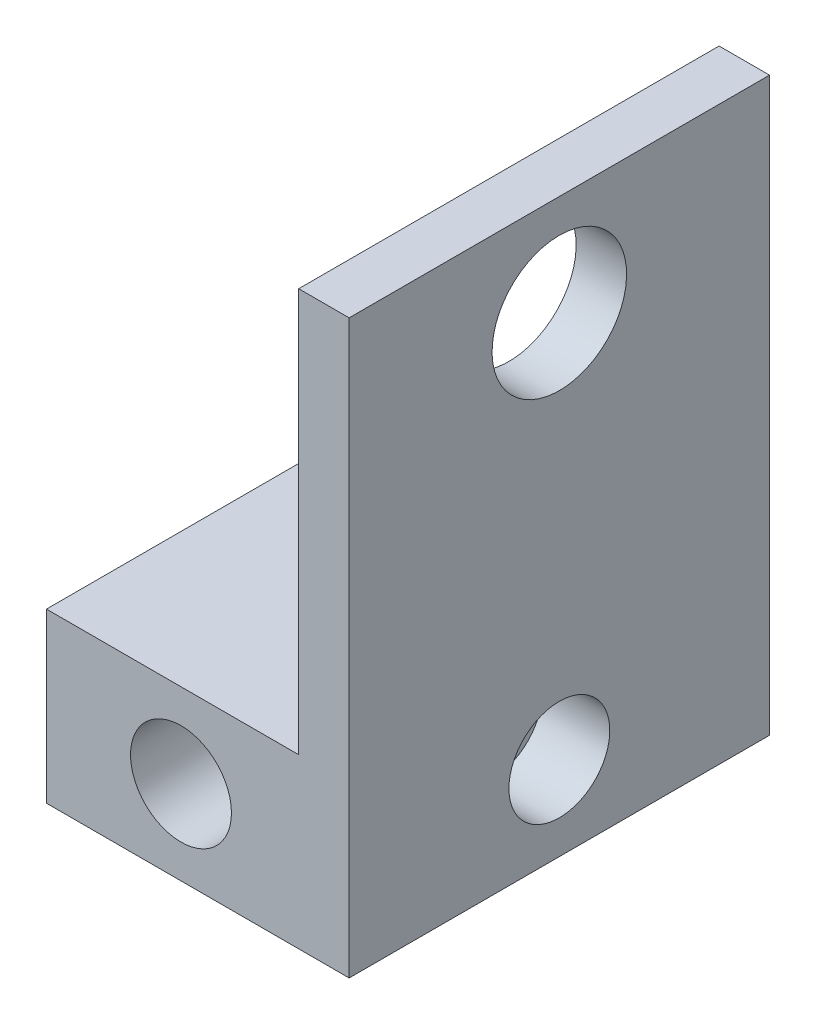
ISO-10303-21;
HEADER;
FILE_DESCRIPTION(('STEP AP214'),'2;1');
FILE_NAME('part.step','',(''),(''),'','','');
FILE_SCHEMA(('AUTOMOTIVE_DESIGN { 1 0 10303 214 1 1 1 1 }'));
ENDSEC;
DATA;
#1=APPLICATION_CONTEXT('core data for automotive mechanical design processes');
#2=APPLICATION_PROTOCOL_DEFINITION('international standard','automotive_design',2000,#1);
#3=PRODUCT_CONTEXT('',#1,'mechanical');
#4=PRODUCT('Part','Part','',(#3));
#5=PRODUCT_RELATED_PRODUCT_CATEGORY('part','',(#4));
#6=PRODUCT_DEFINITION_FORMATION('','',#4);
#7=PRODUCT_DEFINITION_CONTEXT('part definition',#1,'design');
#8=PRODUCT_DEFINITION('design','',#6,#7);
#9=PRODUCT_DEFINITION_SHAPE('','',#8);
#10=(LENGTH_UNIT() NAMED_UNIT(*) SI_UNIT(.MILLI.,.METRE.));
#11=(NAMED_UNIT(*) PLANE_ANGLE_UNIT() SI_UNIT($,.RADIAN.));
#12=(NAMED_UNIT(*) SI_UNIT($,.STERADIAN.) SOLID_ANGLE_UNIT());
#13=UNCERTAINTY_MEASURE_WITH_UNIT(LENGTH_MEASURE(1.E-05),#10,'distance_accuracy_value','');
#14=(GEOMETRIC_REPRESENTATION_CONTEXT(3) GLOBAL_UNCERTAINTY_ASSIGNED_CONTEXT((#13)) GLOBAL_UNIT_ASSIGNED_CONTEXT((#10,
#11,#12)) REPRESENTATION_CONTEXT('',''));
#15=CARTESIAN_POINT('',(0.,0.,0.));
#16=DIRECTION('',(0.,0.,1.));
#17=DIRECTION('',(1.,0.,0.));
#18=AXIS2_PLACEMENT_3D('',#15,#16,#17);
#19=CARTESIAN_POINT('',(0.,0.,25.));
#20=DIRECTION('',(1.,0.,0.));
#21=DIRECTION('',(0.,1.,0.));
#22=AXIS2_PLACEMENT_3D('',#19,#20,#21);
#23=PLANE('',#22);
#24=DIRECTION('',(0.,-1.,0.));
#25=VECTOR('',#24,1.);
#26=CARTESIAN_POINT('',(0.,0.,25.));
#27=LINE('',#26,#25);
#28=CARTESIAN_POINT('',(0.,-24.,25.));
#29=VERTEX_POINT('',#28);
#30=CARTESIAN_POINT('',(0.,-34.,25.));
#31=VERTEX_POINT('',#30);
#32=EDGE_CURVE('E82',#29,#31,#27,.T.);
#33=ORIENTED_EDGE('',*,*,#32,.F.);
#34=DIRECTION('',(0.,0.,1.));
#35=VECTOR('',#34,1.);
#36=CARTESIAN_POINT('',(0.,-24.,0.));
#37=LINE('',#36,#35);
#38=CARTESIAN_POINT('',(0.,-24.,0.));
#39=VERTEX_POINT('',#38);
#40=EDGE_CURVE('E102',#39,#29,#37,.T.);
#41=ORIENTED_EDGE('',*,*,#40,.F.);
#42=DIRECTION('',(0.,-1.,0.));
#43=VECTOR('',#42,1.);
#44=CARTESIAN_POINT('',(0.,0.,0.));
#45=LINE('',#44,#43);
#46=CARTESIAN_POINT('',(0.,-34.,0.));
#47=VERTEX_POINT('',#46);
#48=EDGE_CURVE('E110',#39,#47,#45,.T.);
#49=ORIENTED_EDGE('',*,*,#48,.T.);
#50=DIRECTION('',(0.,0.,-1.));
#51=VECTOR('',#50,1.);
#52=CARTESIAN_POINT('',(0.,-34.,25.));
#53=LINE('',#52,#51);
#54=EDGE_CURVE('E11',#31,#47,#53,.T.);
#55=ORIENTED_EDGE('',*,*,#54,.F.);
#56=EDGE_LOOP('',(#33,#41,#49,#55));
#57=FACE_BOUND('',#56,.T.);
#58=ADVANCED_FACE('F36',(#57),#23,.F.);
#59=CARTESIAN_POINT('',(0.,-34.,25.));
#60=DIRECTION('',(0.,1.,0.));
#61=DIRECTION('',(0.,0.,1.));
#62=AXIS2_PLACEMENT_3D('',#59,#60,#61);
#63=PLANE('',#62);
#64=DIRECTION('',(1.,0.,0.));
#65=VECTOR('',#64,1.);
#66=CARTESIAN_POINT('',(0.,-34.,0.));
#67=LINE('',#66,#65);
#68=CARTESIAN_POINT('',(18.,-34.,0.));
#69=VERTEX_POINT('',#68);
#70=EDGE_CURVE('E114',#47,#69,#67,.T.);
#71=ORIENTED_EDGE('',*,*,#70,.T.);
#72=DIRECTION('',(0.,0.,-1.));
#73=VECTOR('',#72,1.);
#74=CARTESIAN_POINT('',(18.,-34.,25.));
#75=LINE('',#74,#73);
#76=CARTESIAN_POINT('',(18.,-34.,25.));
#77=VERTEX_POINT('',#76);
#78=EDGE_CURVE('E44',#77,#69,#75,.T.);
#79=ORIENTED_EDGE('',*,*,#78,.F.);
#80=DIRECTION('',(1.,0.,0.));
#81=VECTOR('',#80,1.);
#82=CARTESIAN_POINT('',(0.,-34.,25.));
#83=LINE('',#82,#81);
#84=EDGE_CURVE('E141',#31,#77,#83,.T.);
#85=ORIENTED_EDGE('',*,*,#84,.F.);
#86=ORIENTED_EDGE('',*,*,#54,.T.);
#87=EDGE_LOOP('',(#71,#79,#85,#86));
#88=FACE_BOUND('',#87,.T.);
#89=ADVANCED_FACE('F179',(#88),#63,.F.);
#90=CARTESIAN_POINT('',(18.,0.,25.));
#91=DIRECTION('',(-1.,0.,0.));
#92=DIRECTION('',(0.,-1.,0.));
#93=AXIS2_PLACEMENT_3D('',#90,#91,#92);
#94=PLANE('',#93);
#95=CARTESIAN_POINT('',(18.,-6.,12.5));
#96=DIRECTION('',(1.,0.,0.));
#97=DIRECTION('',(0.,1.,0.));
#98=AXIS2_PLACEMENT_3D('',#95,#96,#97);
#99=CIRCLE('',#98,4.);
#100=CARTESIAN_POINT('',(18.,-2.,12.5));
#101=VERTEX_POINT('',#100);
#102=EDGE_CURVE('E159',#101,#101,#99,.T.);
#103=ORIENTED_EDGE('',*,*,#102,.F.);
#104=EDGE_LOOP('',(#103));
#105=FACE_BOUND('',#104,.T.);
#106=CARTESIAN_POINT('',(18.,-29.,12.5));
#107=DIRECTION('',(1.,0.,0.));
#108=DIRECTION('',(0.,1.,0.));
#109=AXIS2_PLACEMENT_3D('',#106,#107,#108);
#110=CIRCLE('',#109,3.);
#111=CARTESIAN_POINT('',(18.,-26.,12.5));
#112=VERTEX_POINT('',#111);
#113=EDGE_CURVE('E154',#112,#112,#110,.T.);
#114=ORIENTED_EDGE('',*,*,#113,.F.);
#115=EDGE_LOOP('',(#114));
#116=FACE_BOUND('',#115,.T.);
#117=DIRECTION('',(0.,1.,0.));
#118=VECTOR('',#117,1.);
#119=CARTESIAN_POINT('',(18.,0.,0.));
#120=LINE('',#119,#118);
#121=CARTESIAN_POINT('',(18.,0.,0.));
#122=VERTEX_POINT('',#121);
#123=EDGE_CURVE('E77',#69,#122,#120,.T.);
#124=ORIENTED_EDGE('',*,*,#123,.T.);
#125=DIRECTION('',(0.,0.,-1.));
#126=VECTOR('',#125,1.);
#127=CARTESIAN_POINT('',(18.,0.,25.));
#128=LINE('',#127,#126);
#129=CARTESIAN_POINT('',(18.,0.,25.));
#130=VERTEX_POINT('',#129);
#131=EDGE_CURVE('E129',#130,#122,#128,.T.);
#132=ORIENTED_EDGE('',*,*,#131,.F.);
#133=DIRECTION('',(0.,1.,0.));
#134=VECTOR('',#133,1.);
#135=CARTESIAN_POINT('',(18.,0.,25.));
#136=LINE('',#135,#134);
#137=EDGE_CURVE('E60',#77,#130,#136,.T.);
#138=ORIENTED_EDGE('',*,*,#137,.F.);
#139=ORIENTED_EDGE('',*,*,#78,.T.);
#140=EDGE_LOOP('',(#124,#132,#138,#139));
#141=FACE_BOUND('',#140,.T.);
#142=ADVANCED_FACE('F132',(#105,#116,#141),#94,.F.);
#143=CARTESIAN_POINT('',(0.,0.,25.));
#144=DIRECTION('',(0.,-1.,0.));
#145=DIRECTION('',(0.,0.,-1.));
#146=AXIS2_PLACEMENT_3D('',#143,#144,#145);
#147=PLANE('',#146);
#148=DIRECTION('',(-1.,0.,0.));
#149=VECTOR('',#148,1.);
#150=CARTESIAN_POINT('',(0.,0.,0.));
#151=LINE('',#150,#149);
#152=CARTESIAN_POINT('',(15.,0.,0.));
#153=VERTEX_POINT('',#152);
#154=EDGE_CURVE('E126',#122,#153,#151,.T.);
#155=ORIENTED_EDGE('',*,*,#154,.T.);
#156=DIRECTION('',(0.,0.,1.));
#157=VECTOR('',#156,1.);
#158=CARTESIAN_POINT('',(15.,0.,0.));
#159=LINE('',#158,#157);
#160=CARTESIAN_POINT('',(15.,0.,25.));
#161=VERTEX_POINT('',#160);
#162=EDGE_CURVE('E139',#153,#161,#159,.T.);
#163=ORIENTED_EDGE('',*,*,#162,.T.);
#164=DIRECTION('',(-1.,0.,0.));
#165=VECTOR('',#164,1.);
#166=CARTESIAN_POINT('',(0.,0.,25.));
#167=LINE('',#166,#165);
#168=EDGE_CURVE('E122',#130,#161,#167,.T.);
#169=ORIENTED_EDGE('',*,*,#168,.F.);
#170=ORIENTED_EDGE('',*,*,#131,.T.);
#171=EDGE_LOOP('',(#155,#163,#169,#170));
#172=FACE_BOUND('',#171,.T.);
#173=ADVANCED_FACE('F137',(#172),#147,.F.);
#174=CARTESIAN_POINT('',(0.,0.,25.));
#175=DIRECTION('',(0.,0.,1.));
#176=DIRECTION('',(1.,0.,0.));
#177=AXIS2_PLACEMENT_3D('',#174,#175,#176);
#178=PLANE('',#177);
#179=CARTESIAN_POINT('',(8.,-29.,25.));
#180=DIRECTION('',(0.,0.,1.));
#181=DIRECTION('',(1.,0.,0.));
#182=AXIS2_PLACEMENT_3D('',#179,#180,#181);
#183=CIRCLE('',#182,3.);
#184=CARTESIAN_POINT('',(11.,-29.,25.));
#185=VERTEX_POINT('',#184);
#186=EDGE_CURVE('E119',#185,#185,#183,.T.);
#187=ORIENTED_EDGE('',*,*,#186,.F.);
#188=EDGE_LOOP('',(#187));
#189=FACE_BOUND('',#188,.T.);
#190=DIRECTION('',(0.,1.,0.));
#191=VECTOR('',#190,1.);
#192=CARTESIAN_POINT('',(15.,0.,25.));
#193=LINE('',#192,#191);
#194=CARTESIAN_POINT('',(15.,-24.,25.));
#195=VERTEX_POINT('',#194);
#196=EDGE_CURVE('E106',#195,#161,#193,.T.);
#197=ORIENTED_EDGE('',*,*,#196,.F.);
#198=DIRECTION('',(1.,0.,0.));
#199=VECTOR('',#198,1.);
#200=CARTESIAN_POINT('',(0.,-24.,25.));
#201=LINE('',#200,#199);
#202=EDGE_CURVE('E148',#29,#195,#201,.T.);
#203=ORIENTED_EDGE('',*,*,#202,.F.);
#204=ORIENTED_EDGE('',*,*,#32,.T.);
#205=ORIENTED_EDGE('',*,*,#84,.T.);
#206=ORIENTED_EDGE('',*,*,#137,.T.);
#207=ORIENTED_EDGE('',*,*,#168,.T.);
#208=EDGE_LOOP('',(#197,#203,#204,#205,#206,#207));
#209=FACE_BOUND('',#208,.T.);
#210=ADVANCED_FACE('F191',(#189,#209),#178,.T.);
#211=CARTESIAN_POINT('',(0.,0.,0.));
#212=DIRECTION('',(0.,0.,1.));
#213=DIRECTION('',(1.,0.,0.));
#214=AXIS2_PLACEMENT_3D('',#211,#212,#213);
#215=PLANE('',#214);
#216=CARTESIAN_POINT('',(8.,-29.,0.));
#217=DIRECTION('',(0.,0.,1.));
#218=DIRECTION('',(1.,0.,0.));
#219=AXIS2_PLACEMENT_3D('',#216,#217,#218);
#220=CIRCLE('',#219,3.);
#221=CARTESIAN_POINT('',(11.,-29.,0.));
#222=VERTEX_POINT('',#221);
#223=EDGE_CURVE('E115',#222,#222,#220,.T.);
#224=ORIENTED_EDGE('',*,*,#223,.T.);
#225=EDGE_LOOP('',(#224));
#226=FACE_BOUND('',#225,.T.);
#227=DIRECTION('',(1.,0.,0.));
#228=VECTOR('',#227,1.);
#229=CARTESIAN_POINT('',(0.,-24.,0.));
#230=LINE('',#229,#228);
#231=CARTESIAN_POINT('',(15.,-24.,0.));
#232=VERTEX_POINT('',#231);
#233=EDGE_CURVE('E98',#39,#232,#230,.T.);
#234=ORIENTED_EDGE('',*,*,#233,.T.);
#235=DIRECTION('',(0.,1.,0.));
#236=VECTOR('',#235,1.);
#237=CARTESIAN_POINT('',(15.,0.,0.));
#238=LINE('',#237,#236);
#239=EDGE_CURVE('E51',#232,#153,#238,.T.);
#240=ORIENTED_EDGE('',*,*,#239,.T.);
#241=ORIENTED_EDGE('',*,*,#154,.F.);
#242=ORIENTED_EDGE('',*,*,#123,.F.);
#243=ORIENTED_EDGE('',*,*,#70,.F.);
#244=ORIENTED_EDGE('',*,*,#48,.F.);
#245=EDGE_LOOP('',(#234,#240,#241,#242,#243,#244));
#246=FACE_BOUND('',#245,.T.);
#247=ADVANCED_FACE('F113',(#226,#246),#215,.F.);
#248=CARTESIAN_POINT('',(15.,0.,0.));
#249=DIRECTION('',(1.,0.,0.));
#250=DIRECTION('',(0.,1.,0.));
#251=AXIS2_PLACEMENT_3D('',#248,#249,#250);
#252=PLANE('',#251);
#253=CARTESIAN_POINT('',(15.,-6.00000000000001,12.5));
#254=DIRECTION('',(1.,0.,0.));
#255=DIRECTION('',(0.,1.,0.));
#256=AXIS2_PLACEMENT_3D('',#253,#254,#255);
#257=CIRCLE('',#256,4.);
#258=CARTESIAN_POINT('',(15.,-2.,12.5));
#259=VERTEX_POINT('',#258);
#260=EDGE_CURVE('E39',#259,#259,#257,.T.);
#261=ORIENTED_EDGE('',*,*,#260,.T.);
#262=EDGE_LOOP('',(#261));
#263=FACE_BOUND('',#262,.T.);
#264=ORIENTED_EDGE('',*,*,#196,.T.);
#265=ORIENTED_EDGE('',*,*,#162,.F.);
#266=ORIENTED_EDGE('',*,*,#239,.F.);
#267=DIRECTION('',(0.,0.,1.));
#268=VECTOR('',#267,1.);
#269=CARTESIAN_POINT('',(15.,-24.,0.));
#270=LINE('',#269,#268);
#271=EDGE_CURVE('E103',#232,#195,#270,.T.);
#272=ORIENTED_EDGE('',*,*,#271,.T.);
#273=EDGE_LOOP('',(#264,#265,#266,#272));
#274=FACE_BOUND('',#273,.T.);
#275=ADVANCED_FACE('F166',(#263,#274),#252,.F.);
#276=CARTESIAN_POINT('',(0.,-24.,0.));
#277=DIRECTION('',(0.,-1.,0.));
#278=DIRECTION('',(0.,0.,-1.));
#279=AXIS2_PLACEMENT_3D('',#276,#277,#278);
#280=PLANE('',#279);
#281=ORIENTED_EDGE('',*,*,#202,.T.);
#282=ORIENTED_EDGE('',*,*,#271,.F.);
#283=ORIENTED_EDGE('',*,*,#233,.F.);
#284=ORIENTED_EDGE('',*,*,#40,.T.);
#285=EDGE_LOOP('',(#281,#282,#283,#284));
#286=FACE_BOUND('',#285,.T.);
#287=ADVANCED_FACE('F101',(#286),#280,.F.);
#288=CARTESIAN_POINT('',(8.,-29.,0.));
#289=DIRECTION('',(0.,0.,1.));
#290=DIRECTION('',(1.,0.,0.));
#291=AXIS2_PLACEMENT_3D('',#288,#289,#290);
#292=CYLINDRICAL_SURFACE('',#291,3.);
#293=ORIENTED_EDGE('',*,*,#223,.F.);
#294=EDGE_LOOP('',(#293));
#295=FACE_BOUND('',#294,.T.);
#296=ORIENTED_EDGE('',*,*,#186,.T.);
#297=EDGE_LOOP('',(#296));
#298=FACE_BOUND('',#297,.T.);
#299=ADVANCED_FACE('F200',(#295,#298),#292,.F.);
#300=CARTESIAN_POINT('',(14.,-29.,12.5));
#301=DIRECTION('',(1.,0.,0.));
#302=DIRECTION('',(0.,1.,0.));
#303=AXIS2_PLACEMENT_3D('',#300,#301,#302);
#304=CYLINDRICAL_SURFACE('',#303,3.);
#305=CARTESIAN_POINT('',(14.,-29.,12.5));
#306=DIRECTION('',(1.,0.,0.));
#307=DIRECTION('',(0.,1.,0.));
#308=AXIS2_PLACEMENT_3D('',#305,#306,#307);
#309=CIRCLE('',#308,3.);
#310=CARTESIAN_POINT('',(14.,-26.,12.5));
#311=VERTEX_POINT('',#310);
#312=EDGE_CURVE('E150',#311,#311,#309,.T.);
#313=ORIENTED_EDGE('',*,*,#312,.F.);
#314=EDGE_LOOP('',(#313));
#315=FACE_BOUND('',#314,.T.);
#316=ORIENTED_EDGE('',*,*,#113,.T.);
#317=EDGE_LOOP('',(#316));
#318=FACE_BOUND('',#317,.T.);
#319=ADVANCED_FACE('F175',(#315,#318),#304,.F.);
#320=CARTESIAN_POINT('',(14.,-29.,12.5));
#321=DIRECTION('',(1.,0.,0.));
#322=DIRECTION('',(0.,1.,0.));
#323=AXIS2_PLACEMENT_3D('',#320,#321,#322);
#324=PLANE('',#323);
#325=ORIENTED_EDGE('',*,*,#312,.T.);
#326=EDGE_LOOP('',(#325));
#327=FACE_BOUND('',#326,.T.);
#328=ADVANCED_FACE('F170',(#327),#324,.T.);
#329=CARTESIAN_POINT('',(0.,-6.00000000000001,12.5));
#330=DIRECTION('',(1.,0.,0.));
#331=DIRECTION('',(0.,1.,0.));
#332=AXIS2_PLACEMENT_3D('',#329,#330,#331);
#333=CYLINDRICAL_SURFACE('',#332,4.);
#334=ORIENTED_EDGE('',*,*,#102,.T.);
#335=EDGE_LOOP('',(#334));
#336=FACE_BOUND('',#335,.T.);
#337=ORIENTED_EDGE('',*,*,#260,.F.);
#338=EDGE_LOOP('',(#337));
#339=FACE_BOUND('',#338,.T.);
#340=ADVANCED_FACE('F168',(#336,#339),#333,.F.);
#341=CLOSED_SHELL('',(#58,#89,#142,#173,#210,#247,#275,#287,#299,#319,#328,#340));
#342=MANIFOLD_SOLID_BREP('B2',#341);
#343=ADVANCED_BREP_SHAPE_REPRESENTATION('',(#18,#342),#14);
#344=SHAPE_DEFINITION_REPRESENTATION(#9,#343);
ENDSEC;
END-ISO-10303-21;
